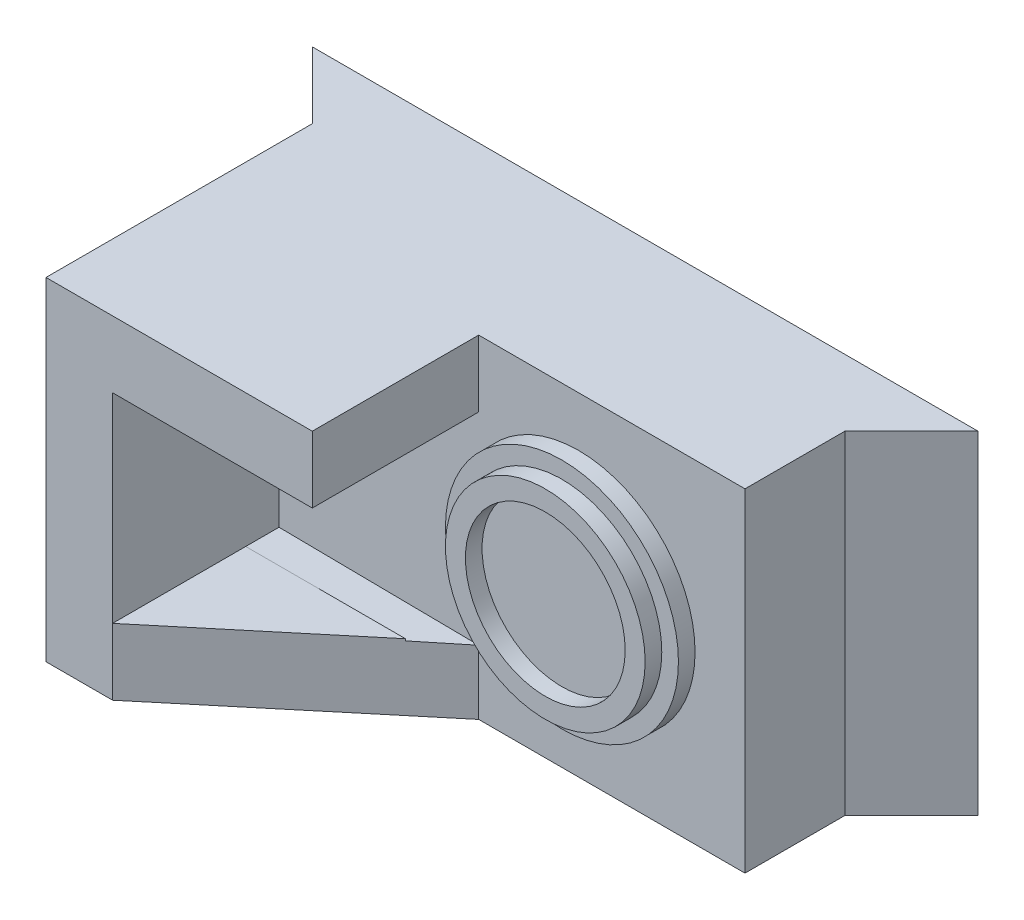
ISO-10303-21;
HEADER;
FILE_DESCRIPTION(('STEP AP214'),'2;1');
FILE_NAME('part.step','',(''),(''),'','','');
FILE_SCHEMA(('AUTOMOTIVE_DESIGN { 1 0 10303 214 1 1 1 1 }'));
ENDSEC;
DATA;
#1=APPLICATION_CONTEXT('core data for automotive mechanical design processes');
#2=APPLICATION_PROTOCOL_DEFINITION('international standard','automotive_design',2000,#1);
#3=PRODUCT_CONTEXT('',#1,'mechanical');
#4=PRODUCT('Part','Part','',(#3));
#5=PRODUCT_RELATED_PRODUCT_CATEGORY('part','',(#4));
#6=PRODUCT_DEFINITION_FORMATION('','',#4);
#7=PRODUCT_DEFINITION_CONTEXT('part definition',#1,'design');
#8=PRODUCT_DEFINITION('design','',#6,#7);
#9=PRODUCT_DEFINITION_SHAPE('','',#8);
#10=(LENGTH_UNIT() NAMED_UNIT(*) SI_UNIT(.MILLI.,.METRE.));
#11=(NAMED_UNIT(*) PLANE_ANGLE_UNIT() SI_UNIT($,.RADIAN.));
#12=(NAMED_UNIT(*) SI_UNIT($,.STERADIAN.) SOLID_ANGLE_UNIT());
#13=UNCERTAINTY_MEASURE_WITH_UNIT(LENGTH_MEASURE(1.E-05),#10,'distance_accuracy_value','');
#14=(GEOMETRIC_REPRESENTATION_CONTEXT(3) GLOBAL_UNCERTAINTY_ASSIGNED_CONTEXT((#13)) GLOBAL_UNIT_ASSIGNED_CONTEXT((#10,
#11,#12)) REPRESENTATION_CONTEXT('',''));
#15=CARTESIAN_POINT('',(0.,0.,0.));
#16=DIRECTION('',(0.,0.,1.));
#17=DIRECTION('',(1.,0.,0.));
#18=AXIS2_PLACEMENT_3D('',#15,#16,#17);
#19=CARTESIAN_POINT('',(34.8916408668731,-6.11455108359133,27.5));
#20=DIRECTION('',(0.,0.,1.));
#21=DIRECTION('',(1.,0.,0.));
#22=AXIS2_PLACEMENT_3D('',#19,#20,#21);
#23=CYLINDRICAL_SURFACE('',#22,17.5);
#24=CARTESIAN_POINT('',(34.8916408668731,-6.11455108359133,25.));
#25=DIRECTION('',(0.,0.,1.));
#26=DIRECTION('',(1.,0.,0.));
#27=AXIS2_PLACEMENT_3D('',#24,#25,#26);
#28=CIRCLE('',#27,17.5);
#29=CARTESIAN_POINT('',(52.3916408668731,-6.11455108359133,25.));
#30=VERTEX_POINT('',#29);
#31=EDGE_CURVE('E264',#30,#30,#28,.T.);
#32=ORIENTED_EDGE('',*,*,#31,.T.);
#33=EDGE_LOOP('',(#32));
#34=FACE_BOUND('',#33,.T.);
#35=CARTESIAN_POINT('',(34.8916408668731,-6.11455108359133,27.5));
#36=DIRECTION('',(0.,0.,1.));
#37=DIRECTION('',(1.,0.,0.));
#38=AXIS2_PLACEMENT_3D('',#35,#36,#37);
#39=CIRCLE('',#38,17.5);
#40=CARTESIAN_POINT('',(52.3916408668731,-6.11455108359133,27.5));
#41=VERTEX_POINT('',#40);
#42=EDGE_CURVE('E279',#41,#41,#39,.T.);
#43=ORIENTED_EDGE('',*,*,#42,.F.);
#44=EDGE_LOOP('',(#43));
#45=FACE_BOUND('',#44,.T.);
#46=ADVANCED_FACE('F45',(#34,#45),#23,.T.);
#47=CARTESIAN_POINT('',(59.8916408668731,18.8854489164087,10.));
#48=DIRECTION('',(-1.,0.,0.));
#49=DIRECTION('',(0.,0.,1.));
#50=AXIS2_PLACEMENT_3D('',#47,#48,#49);
#51=PLANE('',#50);
#52=DIRECTION('',(0.,1.,0.));
#53=VECTOR('',#52,1.);
#54=CARTESIAN_POINT('',(59.8916408668731,0.,25.));
#55=LINE('',#54,#53);
#56=CARTESIAN_POINT('',(59.8916408668731,-31.1145510835913,25.));
#57=VERTEX_POINT('',#56);
#58=CARTESIAN_POINT('',(59.8916408668731,18.8854489164087,25.));
#59=VERTEX_POINT('',#58);
#60=EDGE_CURVE('E256',#57,#59,#55,.T.);
#61=ORIENTED_EDGE('',*,*,#60,.F.);
#62=DIRECTION('',(0.,0.,-1.));
#63=VECTOR('',#62,1.);
#64=CARTESIAN_POINT('',(59.8916408668731,-31.1145510835913,10.));
#65=LINE('',#64,#63);
#66=CARTESIAN_POINT('',(59.8916408668731,-31.1145510835913,10.));
#67=VERTEX_POINT('',#66);
#68=EDGE_CURVE('E202',#57,#67,#65,.T.);
#69=ORIENTED_EDGE('',*,*,#68,.T.);
#70=DIRECTION('',(0.,-1.,0.));
#71=VECTOR('',#70,1.);
#72=CARTESIAN_POINT('',(59.8916408668731,18.8854489164087,10.));
#73=LINE('',#72,#71);
#74=CARTESIAN_POINT('',(59.8916408668731,18.8854489164087,10.));
#75=VERTEX_POINT('',#74);
#76=EDGE_CURVE('E192',#75,#67,#73,.T.);
#77=ORIENTED_EDGE('',*,*,#76,.F.);
#78=DIRECTION('',(0.,0.,-1.));
#79=VECTOR('',#78,1.);
#80=CARTESIAN_POINT('',(59.8916408668731,18.8854489164087,10.));
#81=LINE('',#80,#79);
#82=EDGE_CURVE('E211',#59,#75,#81,.T.);
#83=ORIENTED_EDGE('',*,*,#82,.F.);
#84=EDGE_LOOP('',(#61,#69,#77,#83));
#85=FACE_BOUND('',#84,.T.);
#86=ADVANCED_FACE('F321',(#85),#51,.F.);
#87=CARTESIAN_POINT('',(19.8916408668731,-31.1145510835913,30.));
#88=DIRECTION('',(-1.,0.,0.));
#89=DIRECTION('',(0.,0.,1.));
#90=AXIS2_PLACEMENT_3D('',#87,#88,#89);
#91=PLANE('',#90);
#92=DIRECTION('',(0.,-1.,0.));
#93=VECTOR('',#92,1.);
#94=CARTESIAN_POINT('',(19.8916408668731,-31.1145510835913,50.));
#95=LINE('',#94,#93);
#96=CARTESIAN_POINT('',(19.8916408668731,18.8854489164087,50.));
#97=VERTEX_POINT('',#96);
#98=CARTESIAN_POINT('',(19.8916408668731,8.88544891640867,50.));
#99=VERTEX_POINT('',#98);
#100=EDGE_CURVE('E185',#97,#99,#95,.T.);
#101=ORIENTED_EDGE('',*,*,#100,.T.);
#102=DIRECTION('',(0.,0.,1.));
#103=VECTOR('',#102,1.);
#104=CARTESIAN_POINT('',(19.8916408668731,8.88544891640867,30.));
#105=LINE('',#104,#103);
#106=CARTESIAN_POINT('',(19.8916408668731,8.88544891640867,25.));
#107=VERTEX_POINT('',#106);
#108=EDGE_CURVE('E186',#107,#99,#105,.T.);
#109=ORIENTED_EDGE('',*,*,#108,.F.);
#110=DIRECTION('',(0.,-1.,0.));
#111=VECTOR('',#110,1.);
#112=CARTESIAN_POINT('',(19.8916408668731,0.,25.));
#113=LINE('',#112,#111);
#114=CARTESIAN_POINT('',(19.8916408668731,18.8854489164087,25.));
#115=VERTEX_POINT('',#114);
#116=EDGE_CURVE('E176',#115,#107,#113,.T.);
#117=ORIENTED_EDGE('',*,*,#116,.F.);
#118=DIRECTION('',(0.,0.,1.));
#119=VECTOR('',#118,1.);
#120=CARTESIAN_POINT('',(19.8916408668731,18.8854489164087,30.));
#121=LINE('',#120,#119);
#122=EDGE_CURVE('E190',#115,#97,#121,.T.);
#123=ORIENTED_EDGE('',*,*,#122,.T.);
#124=EDGE_LOOP('',(#101,#109,#117,#123));
#125=FACE_BOUND('',#124,.T.);
#126=ADVANCED_FACE('F248',(#125),#91,.F.);
#127=CARTESIAN_POINT('',(-30.1083591331269,-31.1145510835913,50.));
#128=DIRECTION('',(0.,1.,0.));
#129=DIRECTION('',(0.,0.,1.));
#130=AXIS2_PLACEMENT_3D('',#127,#128,#129);
#131=PLANE('',#130);
#132=DIRECTION('',(1.,0.,0.));
#133=VECTOR('',#132,1.);
#134=CARTESIAN_POINT('',(0.,-31.1145510835913,25.));
#135=LINE('',#134,#133);
#136=CARTESIAN_POINT('',(19.8916408668731,-31.1145510835913,25.));
#137=VERTEX_POINT('',#136);
#138=EDGE_CURVE('E257',#137,#57,#135,.T.);
#139=ORIENTED_EDGE('',*,*,#138,.F.);
#140=DIRECTION('',(0.768221279597376,0.,-0.64018439966448));
#141=VECTOR('',#140,1.);
#142=CARTESIAN_POINT('',(-10.1083591331269,-31.1145510835913,50.));
#143=LINE('',#142,#141);
#144=CARTESIAN_POINT('',(-10.1083591331269,-31.1145510835913,50.));
#145=VERTEX_POINT('',#144);
#146=EDGE_CURVE('E150',#145,#137,#143,.T.);
#147=ORIENTED_EDGE('',*,*,#146,.F.);
#148=DIRECTION('',(1.,0.,0.));
#149=VECTOR('',#148,1.);
#150=CARTESIAN_POINT('',(-30.1083591331269,-31.1145510835913,50.));
#151=LINE('',#150,#149);
#152=CARTESIAN_POINT('',(-20.1083591331269,-31.1145510835913,50.));
#153=VERTEX_POINT('',#152);
#154=EDGE_CURVE('E161',#153,#145,#151,.T.);
#155=ORIENTED_EDGE('',*,*,#154,.F.);
#156=DIRECTION('',(0.,0.,1.));
#157=VECTOR('',#156,1.);
#158=CARTESIAN_POINT('',(-20.1083591331269,-31.1145510835913,10.));
#159=LINE('',#158,#157);
#160=CARTESIAN_POINT('',(-20.1083591331269,-31.1145510835913,10.));
#161=VERTEX_POINT('',#160);
#162=EDGE_CURVE('E195',#161,#153,#159,.T.);
#163=ORIENTED_EDGE('',*,*,#162,.F.);
#164=DIRECTION('',(0.707106781186547,0.,0.707106781186548));
#165=VECTOR('',#164,1.);
#166=CARTESIAN_POINT('',(-30.1083591331269,-31.1145510835913,0.));
#167=LINE('',#166,#165);
#168=CARTESIAN_POINT('',(-30.1083591331269,-31.1145510835913,0.));
#169=VERTEX_POINT('',#168);
#170=EDGE_CURVE('E199',#169,#161,#167,.T.);
#171=ORIENTED_EDGE('',*,*,#170,.F.);
#172=DIRECTION('',(1.,0.,0.));
#173=VECTOR('',#172,1.);
#174=CARTESIAN_POINT('',(-30.1083591331269,-31.1145510835913,0.));
#175=LINE('',#174,#173);
#176=CARTESIAN_POINT('',(69.8916408668731,-31.1145510835913,0.));
#177=VERTEX_POINT('',#176);
#178=EDGE_CURVE('E220',#169,#177,#175,.T.);
#179=ORIENTED_EDGE('',*,*,#178,.T.);
#180=DIRECTION('',(0.707106781186547,0.,-0.707106781186548));
#181=VECTOR('',#180,1.);
#182=CARTESIAN_POINT('',(69.8916408668731,-31.1145510835913,0.));
#183=LINE('',#182,#181);
#184=EDGE_CURVE('E68',#67,#177,#183,.T.);
#185=ORIENTED_EDGE('',*,*,#184,.F.);
#186=ORIENTED_EDGE('',*,*,#68,.F.);
#187=EDGE_LOOP('',(#139,#147,#155,#163,#171,#179,#185,#186));
#188=FACE_BOUND('',#187,.T.);
#189=ADVANCED_FACE('F47',(#188),#131,.F.);
#190=CARTESIAN_POINT('',(-30.1083591331269,18.8854489164087,50.));
#191=DIRECTION('',(0.,-1.,0.));
#192=DIRECTION('',(1.,0.,0.));
#193=AXIS2_PLACEMENT_3D('',#190,#191,#192);
#194=PLANE('',#193);
#195=ORIENTED_EDGE('',*,*,#122,.F.);
#196=DIRECTION('',(-1.,0.,0.));
#197=VECTOR('',#196,1.);
#198=CARTESIAN_POINT('',(0.,18.8854489164087,25.));
#199=LINE('',#198,#197);
#200=EDGE_CURVE('E180',#59,#115,#199,.T.);
#201=ORIENTED_EDGE('',*,*,#200,.F.);
#202=ORIENTED_EDGE('',*,*,#82,.T.);
#203=DIRECTION('',(0.707106781186547,0.,-0.707106781186548));
#204=VECTOR('',#203,1.);
#205=CARTESIAN_POINT('',(69.8916408668731,18.8854489164087,0.));
#206=LINE('',#205,#204);
#207=CARTESIAN_POINT('',(69.8916408668731,18.8854489164087,0.));
#208=VERTEX_POINT('',#207);
#209=EDGE_CURVE('E209',#75,#208,#206,.T.);
#210=ORIENTED_EDGE('',*,*,#209,.T.);
#211=DIRECTION('',(-1.,0.,0.));
#212=VECTOR('',#211,1.);
#213=CARTESIAN_POINT('',(-30.1083591331269,18.8854489164087,0.));
#214=LINE('',#213,#212);
#215=CARTESIAN_POINT('',(-30.1083591331269,18.8854489164087,0.));
#216=VERTEX_POINT('',#215);
#217=EDGE_CURVE('E217',#208,#216,#214,.T.);
#218=ORIENTED_EDGE('',*,*,#217,.T.);
#219=DIRECTION('',(0.707106781186547,0.,0.707106781186548));
#220=VECTOR('',#219,1.);
#221=CARTESIAN_POINT('',(-30.1083591331269,18.8854489164087,0.));
#222=LINE('',#221,#220);
#223=CARTESIAN_POINT('',(-20.1083591331269,18.8854489164087,10.));
#224=VERTEX_POINT('',#223);
#225=EDGE_CURVE('E60',#216,#224,#222,.T.);
#226=ORIENTED_EDGE('',*,*,#225,.T.);
#227=DIRECTION('',(0.,0.,1.));
#228=VECTOR('',#227,1.);
#229=CARTESIAN_POINT('',(-20.1083591331269,18.8854489164087,10.));
#230=LINE('',#229,#228);
#231=CARTESIAN_POINT('',(-20.1083591331269,18.8854489164087,50.));
#232=VERTEX_POINT('',#231);
#233=EDGE_CURVE('E194',#224,#232,#230,.T.);
#234=ORIENTED_EDGE('',*,*,#233,.T.);
#235=DIRECTION('',(-1.,0.,0.));
#236=VECTOR('',#235,1.);
#237=CARTESIAN_POINT('',(-30.1083591331269,18.8854489164087,50.));
#238=LINE('',#237,#236);
#239=EDGE_CURVE('E53',#97,#232,#238,.T.);
#240=ORIENTED_EDGE('',*,*,#239,.F.);
#241=EDGE_LOOP('',(#195,#201,#202,#210,#218,#226,#234,#240));
#242=FACE_BOUND('',#241,.T.);
#243=ADVANCED_FACE('F226',(#242),#194,.F.);
#244=CARTESIAN_POINT('',(0.,0.,50.));
#245=DIRECTION('',(0.,0.,1.));
#246=DIRECTION('',(1.,0.,0.));
#247=AXIS2_PLACEMENT_3D('',#244,#245,#246);
#248=PLANE('',#247);
#249=DIRECTION('',(0.,-1.,0.));
#250=VECTOR('',#249,1.);
#251=CARTESIAN_POINT('',(-10.1083591331269,-21.1145510835913,50.));
#252=LINE('',#251,#250);
#253=CARTESIAN_POINT('',(-10.1083591331269,-21.1145510835913,50.));
#254=VERTEX_POINT('',#253);
#255=EDGE_CURVE('E143',#254,#145,#252,.T.);
#256=ORIENTED_EDGE('',*,*,#255,.F.);
#257=DIRECTION('',(0.,-1.,0.));
#258=VECTOR('',#257,1.);
#259=CARTESIAN_POINT('',(-10.1083591331269,8.88544891640867,50.));
#260=LINE('',#259,#258);
#261=CARTESIAN_POINT('',(-10.1083591331269,8.88544891640867,50.));
#262=VERTEX_POINT('',#261);
#263=EDGE_CURVE('E158',#262,#254,#260,.T.);
#264=ORIENTED_EDGE('',*,*,#263,.F.);
#265=DIRECTION('',(-1.,0.,0.));
#266=VECTOR('',#265,1.);
#267=CARTESIAN_POINT('',(-10.1083591331269,8.88544891640867,50.));
#268=LINE('',#267,#266);
#269=EDGE_CURVE('E170',#99,#262,#268,.T.);
#270=ORIENTED_EDGE('',*,*,#269,.F.);
#271=ORIENTED_EDGE('',*,*,#100,.F.);
#272=ORIENTED_EDGE('',*,*,#239,.T.);
#273=DIRECTION('',(0.,-1.,0.));
#274=VECTOR('',#273,1.);
#275=CARTESIAN_POINT('',(-20.1083591331269,18.8854489164087,50.));
#276=LINE('',#275,#274);
#277=EDGE_CURVE('E204',#232,#153,#276,.T.);
#278=ORIENTED_EDGE('',*,*,#277,.T.);
#279=ORIENTED_EDGE('',*,*,#154,.T.);
#280=EDGE_LOOP('',(#256,#264,#270,#271,#272,#278,#279));
#281=FACE_BOUND('',#280,.T.);
#282=ADVANCED_FACE('F155',(#281),#248,.T.);
#283=CARTESIAN_POINT('',(0.,0.,0.));
#284=DIRECTION('',(0.,0.,1.));
#285=DIRECTION('',(1.,0.,0.));
#286=AXIS2_PLACEMENT_3D('',#283,#284,#285);
#287=PLANE('',#286);
#288=DIRECTION('',(0.,-1.,0.));
#289=VECTOR('',#288,1.);
#290=CARTESIAN_POINT('',(-30.1083591331269,18.8854489164087,0.));
#291=LINE('',#290,#289);
#292=EDGE_CURVE('E206',#216,#169,#291,.T.);
#293=ORIENTED_EDGE('',*,*,#292,.F.);
#294=ORIENTED_EDGE('',*,*,#217,.F.);
#295=DIRECTION('',(0.,1.,0.));
#296=VECTOR('',#295,1.);
#297=CARTESIAN_POINT('',(69.8916408668731,18.8854489164087,0.));
#298=LINE('',#297,#296);
#299=EDGE_CURVE('E222',#177,#208,#298,.T.);
#300=ORIENTED_EDGE('',*,*,#299,.F.);
#301=ORIENTED_EDGE('',*,*,#178,.F.);
#302=EDGE_LOOP('',(#293,#294,#300,#301));
#303=FACE_BOUND('',#302,.T.);
#304=ADVANCED_FACE('F231',(#303),#287,.F.);
#305=CARTESIAN_POINT('',(69.8916408668731,18.8854489164087,0.));
#306=DIRECTION('',(-0.707106781186548,0.,-0.707106781186547));
#307=DIRECTION('',(-0.707106781186547,0.,0.707106781186548));
#308=AXIS2_PLACEMENT_3D('',#305,#306,#307);
#309=PLANE('',#308);
#310=ORIENTED_EDGE('',*,*,#184,.T.);
#311=ORIENTED_EDGE('',*,*,#299,.T.);
#312=ORIENTED_EDGE('',*,*,#209,.F.);
#313=ORIENTED_EDGE('',*,*,#76,.T.);
#314=EDGE_LOOP('',(#310,#311,#312,#313));
#315=FACE_BOUND('',#314,.T.);
#316=ADVANCED_FACE('F345',(#315),#309,.F.);
#317=CARTESIAN_POINT('',(-20.1083591331269,18.8854489164087,10.));
#318=DIRECTION('',(1.,0.,0.));
#319=DIRECTION('',(0.,0.,-1.));
#320=AXIS2_PLACEMENT_3D('',#317,#318,#319);
#321=PLANE('',#320);
#322=ORIENTED_EDGE('',*,*,#162,.T.);
#323=ORIENTED_EDGE('',*,*,#277,.F.);
#324=ORIENTED_EDGE('',*,*,#233,.F.);
#325=DIRECTION('',(0.,-1.,0.));
#326=VECTOR('',#325,1.);
#327=CARTESIAN_POINT('',(-20.1083591331269,18.8854489164087,10.));
#328=LINE('',#327,#326);
#329=EDGE_CURVE('E198',#224,#161,#328,.T.);
#330=ORIENTED_EDGE('',*,*,#329,.T.);
#331=EDGE_LOOP('',(#322,#323,#324,#330));
#332=FACE_BOUND('',#331,.T.);
#333=ADVANCED_FACE('F239',(#332),#321,.F.);
#334=CARTESIAN_POINT('',(-30.1083591331269,18.8854489164087,0.));
#335=DIRECTION('',(0.707106781186548,0.,-0.707106781186547));
#336=DIRECTION('',(-0.707106781186547,0.,-0.707106781186548));
#337=AXIS2_PLACEMENT_3D('',#334,#335,#336);
#338=PLANE('',#337);
#339=ORIENTED_EDGE('',*,*,#170,.T.);
#340=ORIENTED_EDGE('',*,*,#329,.F.);
#341=ORIENTED_EDGE('',*,*,#225,.F.);
#342=ORIENTED_EDGE('',*,*,#292,.T.);
#343=EDGE_LOOP('',(#339,#340,#341,#342));
#344=FACE_BOUND('',#343,.T.);
#345=ADVANCED_FACE('F233',(#344),#338,.F.);
#346=CARTESIAN_POINT('',(-10.1083591331269,8.88544891640867,30.));
#347=DIRECTION('',(-1.,0.,0.));
#348=DIRECTION('',(0.,0.,1.));
#349=AXIS2_PLACEMENT_3D('',#346,#347,#348);
#350=PLANE('',#349);
#351=DIRECTION('',(0.,0.,1.));
#352=VECTOR('',#351,1.);
#353=CARTESIAN_POINT('',(-10.1083591331269,-21.1145510835913,30.));
#354=LINE('',#353,#352);
#355=CARTESIAN_POINT('',(-10.1083591331269,-21.1145510835913,30.));
#356=VERTEX_POINT('',#355);
#357=EDGE_CURVE('E164',#356,#254,#354,.T.);
#358=ORIENTED_EDGE('',*,*,#357,.F.);
#359=CARTESIAN_POINT('',(-10.1083591331269,-21.1145510835913,25.));
#360=VERTEX_POINT('',#359);
#361=EDGE_CURVE('E169',#360,#356,#354,.T.);
#362=ORIENTED_EDGE('',*,*,#361,.F.);
#363=DIRECTION('',(0.,-1.,0.));
#364=VECTOR('',#363,1.);
#365=CARTESIAN_POINT('',(-10.1083591331269,0.,25.));
#366=LINE('',#365,#364);
#367=CARTESIAN_POINT('',(-10.1083591331269,8.88544891640867,25.));
#368=VERTEX_POINT('',#367);
#369=EDGE_CURVE('E272',#368,#360,#366,.T.);
#370=ORIENTED_EDGE('',*,*,#369,.F.);
#371=DIRECTION('',(0.,0.,1.));
#372=VECTOR('',#371,1.);
#373=CARTESIAN_POINT('',(-10.1083591331269,8.88544891640867,30.));
#374=LINE('',#373,#372);
#375=EDGE_CURVE('E174',#368,#262,#374,.T.);
#376=ORIENTED_EDGE('',*,*,#375,.T.);
#377=ORIENTED_EDGE('',*,*,#263,.T.);
#378=EDGE_LOOP('',(#358,#362,#370,#376,#377));
#379=FACE_BOUND('',#378,.T.);
#380=ADVANCED_FACE('F172',(#379),#350,.F.);
#381=CARTESIAN_POINT('',(-10.1083591331269,8.88544891640867,30.));
#382=DIRECTION('',(0.,1.,0.));
#383=DIRECTION('',(0.,0.,1.));
#384=AXIS2_PLACEMENT_3D('',#381,#382,#383);
#385=PLANE('',#384);
#386=ORIENTED_EDGE('',*,*,#269,.T.);
#387=ORIENTED_EDGE('',*,*,#375,.F.);
#388=DIRECTION('',(-1.,0.,0.));
#389=VECTOR('',#388,1.);
#390=CARTESIAN_POINT('',(0.,8.88544891640867,25.));
#391=LINE('',#390,#389);
#392=EDGE_CURVE('E268',#107,#368,#391,.T.);
#393=ORIENTED_EDGE('',*,*,#392,.F.);
#394=ORIENTED_EDGE('',*,*,#108,.T.);
#395=EDGE_LOOP('',(#386,#387,#393,#394));
#396=FACE_BOUND('',#395,.T.);
#397=ADVANCED_FACE('F333',(#396),#385,.F.);
#398=CARTESIAN_POINT('',(-10.1083591331269,-21.1145510835913,30.));
#399=DIRECTION('',(0.,-1.,0.));
#400=DIRECTION('',(0.,0.,-1.));
#401=AXIS2_PLACEMENT_3D('',#398,#399,#400);
#402=PLANE('',#401);
#403=ORIENTED_EDGE('',*,*,#357,.T.);
#404=DIRECTION('',(0.768221279597376,0.,-0.64018439966448));
#405=VECTOR('',#404,1.);
#406=CARTESIAN_POINT('',(-10.1083591331269,-21.1145510835913,50.));
#407=LINE('',#406,#405);
#408=CARTESIAN_POINT('',(13.8916408668731,-21.1145510835913,30.));
#409=VERTEX_POINT('',#408);
#410=EDGE_CURVE('E140',#254,#409,#407,.T.);
#411=ORIENTED_EDGE('',*,*,#410,.T.);
#412=DIRECTION('',(-1.,0.,0.));
#413=VECTOR('',#412,1.);
#414=CARTESIAN_POINT('',(-10.1083591331269,-21.1145510835913,30.));
#415=LINE('',#414,#413);
#416=EDGE_CURVE('E166',#409,#356,#415,.T.);
#417=ORIENTED_EDGE('',*,*,#416,.T.);
#418=EDGE_LOOP('',(#403,#411,#417));
#419=FACE_BOUND('',#418,.T.);
#420=ADVANCED_FACE('F165',(#419),#402,.F.);
#421=CARTESIAN_POINT('',(0.,0.,25.));
#422=DIRECTION('',(0.,0.,1.));
#423=DIRECTION('',(1.,0.,0.));
#424=AXIS2_PLACEMENT_3D('',#421,#422,#423);
#425=PLANE('',#424);
#426=DIRECTION('',(0.999932698501029,-0.0116016580043561,0.));
#427=VECTOR('',#426,1.);
#428=CARTESIAN_POINT('',(-0.246307883814223,-21.2289749303037,25.));
#429=LINE('',#428,#427);
#430=CARTESIAN_POINT('',(19.8916408668731,-21.4626242495678,25.));
#431=VERTEX_POINT('',#430);
#432=EDGE_CURVE('E274',#360,#431,#429,.T.);
#433=ORIENTED_EDGE('',*,*,#432,.T.);
#434=DIRECTION('',(0.,-1.,0.));
#435=VECTOR('',#434,1.);
#436=CARTESIAN_POINT('',(19.8916408668731,0.,25.));
#437=LINE('',#436,#435);
#438=EDGE_CURVE('E261',#431,#137,#437,.T.);
#439=ORIENTED_EDGE('',*,*,#438,.T.);
#440=ORIENTED_EDGE('',*,*,#138,.T.);
#441=ORIENTED_EDGE('',*,*,#60,.T.);
#442=ORIENTED_EDGE('',*,*,#200,.T.);
#443=ORIENTED_EDGE('',*,*,#116,.T.);
#444=ORIENTED_EDGE('',*,*,#392,.T.);
#445=ORIENTED_EDGE('',*,*,#369,.T.);
#446=EDGE_LOOP('',(#433,#439,#440,#441,#442,#443,#444,#445));
#447=FACE_BOUND('',#446,.T.);
#448=ORIENTED_EDGE('',*,*,#31,.F.);
#449=EDGE_LOOP('',(#448));
#450=FACE_BOUND('',#449,.T.);
#451=ADVANCED_FACE('F253',(#447,#450),#425,.T.);
#452=CARTESIAN_POINT('',(0.,0.,30.));
#453=DIRECTION('',(0.,0.,1.));
#454=DIRECTION('',(1.,0.,0.));
#455=AXIS2_PLACEMENT_3D('',#452,#453,#454);
#456=PLANE('',#455);
#457=ORIENTED_EDGE('',*,*,#416,.F.);
#458=DIRECTION('',(0.,-1.,0.));
#459=VECTOR('',#458,1.);
#460=CARTESIAN_POINT('',(13.8916408668731,0.,30.));
#461=LINE('',#460,#459);
#462=CARTESIAN_POINT('',(13.8916408668731,-21.3930096163725,30.));
#463=VERTEX_POINT('',#462);
#464=EDGE_CURVE('E146',#409,#463,#461,.T.);
#465=ORIENTED_EDGE('',*,*,#464,.T.);
#466=DIRECTION('',(0.999932698501029,-0.0116016580043561,0.));
#467=VECTOR('',#466,1.);
#468=CARTESIAN_POINT('',(-0.246307883814223,-21.2289749303037,30.));
#469=LINE('',#468,#467);
#470=EDGE_CURVE('E269',#356,#463,#469,.T.);
#471=ORIENTED_EDGE('',*,*,#470,.F.);
#472=EDGE_LOOP('',(#457,#465,#471));
#473=FACE_BOUND('',#472,.T.);
#474=ADVANCED_FACE('F420',(#473),#456,.F.);
#475=CARTESIAN_POINT('',(-0.246307883814223,-21.2289749303037,25.));
#476=DIRECTION('',(-0.0116016580043561,-0.999932698501029,0.));
#477=DIRECTION('',(0.999932698501029,-0.0116016580043561,0.));
#478=AXIS2_PLACEMENT_3D('',#475,#476,#477);
#479=PLANE('',#478);
#480=ORIENTED_EDGE('',*,*,#470,.T.);
#481=DIRECTION('',(0.76819076541734,-0.00891288639309096,-0.640158971181116));
#482=VECTOR('',#481,1.);
#483=CARTESIAN_POINT('',(8.00629416586788,-21.3247252410696,34.904455584171));
#484=LINE('',#483,#482);
#485=EDGE_CURVE('E11',#463,#431,#484,.T.);
#486=ORIENTED_EDGE('',*,*,#485,.T.);
#487=ORIENTED_EDGE('',*,*,#432,.F.);
#488=ORIENTED_EDGE('',*,*,#361,.T.);
#489=EDGE_LOOP('',(#480,#486,#487,#488));
#490=FACE_BOUND('',#489,.T.);
#491=ADVANCED_FACE('F408',(#490),#479,.F.);
#492=CARTESIAN_POINT('',(-10.1083591331269,-21.1145510835913,50.));
#493=DIRECTION('',(-0.64018439966448,0.,-0.768221279597376));
#494=DIRECTION('',(-0.768221279597376,0.,0.64018439966448));
#495=AXIS2_PLACEMENT_3D('',#492,#493,#494);
#496=PLANE('',#495);
#497=ORIENTED_EDGE('',*,*,#410,.F.);
#498=ORIENTED_EDGE('',*,*,#255,.T.);
#499=ORIENTED_EDGE('',*,*,#146,.T.);
#500=ORIENTED_EDGE('',*,*,#438,.F.);
#501=ORIENTED_EDGE('',*,*,#485,.F.);
#502=ORIENTED_EDGE('',*,*,#464,.F.);
#503=EDGE_LOOP('',(#497,#498,#499,#500,#501,#502));
#504=FACE_BOUND('',#503,.T.);
#505=ADVANCED_FACE('F142',(#504),#496,.F.);
#506=CARTESIAN_POINT('',(34.8916408668731,-6.11455108359133,27.5));
#507=DIRECTION('',(0.,0.,1.));
#508=DIRECTION('',(1.,0.,0.));
#509=AXIS2_PLACEMENT_3D('',#506,#507,#508);
#510=PLANE('',#509);
#511=CARTESIAN_POINT('',(34.8916408668731,-6.11455108359133,27.5));
#512=DIRECTION('',(0.,0.,1.));
#513=DIRECTION('',(1.,0.,0.));
#514=AXIS2_PLACEMENT_3D('',#511,#512,#513);
#515=CIRCLE('',#514,15.);
#516=CARTESIAN_POINT('',(49.8916408668731,-6.11455108359133,27.5));
#517=VERTEX_POINT('',#516);
#518=EDGE_CURVE('E283',#517,#517,#515,.T.);
#519=ORIENTED_EDGE('',*,*,#518,.F.);
#520=EDGE_LOOP('',(#519));
#521=FACE_BOUND('',#520,.T.);
#522=ORIENTED_EDGE('',*,*,#42,.T.);
#523=EDGE_LOOP('',(#522));
#524=FACE_BOUND('',#523,.T.);
#525=ADVANCED_FACE('F312',(#521,#524),#510,.T.);
#526=CARTESIAN_POINT('',(34.8916408668731,-6.11455108359133,27.5));
#527=DIRECTION('',(0.,0.,1.));
#528=DIRECTION('',(1.,0.,0.));
#529=AXIS2_PLACEMENT_3D('',#526,#527,#528);
#530=CYLINDRICAL_SURFACE('',#529,15.);
#531=ORIENTED_EDGE('',*,*,#518,.T.);
#532=EDGE_LOOP('',(#531));
#533=FACE_BOUND('',#532,.T.);
#534=CARTESIAN_POINT('',(34.8916408668731,-6.11455108359133,30.));
#535=DIRECTION('',(0.,0.,1.));
#536=DIRECTION('',(1.,0.,0.));
#537=AXIS2_PLACEMENT_3D('',#534,#535,#536);
#538=CIRCLE('',#537,15.);
#539=CARTESIAN_POINT('',(49.8916408668731,-6.11455108359133,30.));
#540=VERTEX_POINT('',#539);
#541=EDGE_CURVE('E284',#540,#540,#538,.T.);
#542=ORIENTED_EDGE('',*,*,#541,.F.);
#543=EDGE_LOOP('',(#542));
#544=FACE_BOUND('',#543,.T.);
#545=ADVANCED_FACE('F307',(#533,#544),#530,.T.);
#546=CARTESIAN_POINT('',(0.,0.,30.));
#547=DIRECTION('',(0.,0.,-1.));
#548=DIRECTION('',(-1.,0.,0.));
#549=AXIS2_PLACEMENT_3D('',#546,#547,#548);
#550=PLANE('',#549);
#551=CARTESIAN_POINT('',(34.8916408668731,-6.11455108359133,30.));
#552=DIRECTION('',(0.,0.,1.));
#553=DIRECTION('',(1.,0.,0.));
#554=AXIS2_PLACEMENT_3D('',#551,#552,#553);
#555=CIRCLE('',#554,12.);
#556=CARTESIAN_POINT('',(46.8916408668731,-6.11455108359133,30.));
#557=VERTEX_POINT('',#556);
#558=EDGE_CURVE('E290',#557,#557,#555,.T.);
#559=ORIENTED_EDGE('',*,*,#558,.F.);
#560=EDGE_LOOP('',(#559));
#561=FACE_BOUND('',#560,.T.);
#562=ORIENTED_EDGE('',*,*,#541,.T.);
#563=EDGE_LOOP('',(#562));
#564=FACE_BOUND('',#563,.T.);
#565=ADVANCED_FACE('F301',(#561,#564),#550,.F.);
#566=CARTESIAN_POINT('',(34.8916408668731,-6.11455108359133,27.5));
#567=DIRECTION('',(0.,0.,1.));
#568=DIRECTION('',(1.,0.,0.));
#569=AXIS2_PLACEMENT_3D('',#566,#567,#568);
#570=CYLINDRICAL_SURFACE('',#569,12.);
#571=CARTESIAN_POINT('',(34.8916408668731,-6.11455108359133,27.5));
#572=DIRECTION('',(0.,0.,1.));
#573=DIRECTION('',(1.,0.,0.));
#574=AXIS2_PLACEMENT_3D('',#571,#572,#573);
#575=CIRCLE('',#574,12.);
#576=CARTESIAN_POINT('',(46.8916408668731,-6.11455108359133,27.5));
#577=VERTEX_POINT('',#576);
#578=EDGE_CURVE('E287',#577,#577,#575,.T.);
#579=ORIENTED_EDGE('',*,*,#578,.F.);
#580=EDGE_LOOP('',(#579));
#581=FACE_BOUND('',#580,.T.);
#582=ORIENTED_EDGE('',*,*,#558,.T.);
#583=EDGE_LOOP('',(#582));
#584=FACE_BOUND('',#583,.T.);
#585=ADVANCED_FACE('F298',(#581,#584),#570,.F.);
#586=CARTESIAN_POINT('',(34.8916408668731,-6.11455108359133,27.5));
#587=DIRECTION('',(0.,0.,1.));
#588=DIRECTION('',(1.,0.,0.));
#589=AXIS2_PLACEMENT_3D('',#586,#587,#588);
#590=PLANE('',#589);
#591=ORIENTED_EDGE('',*,*,#578,.T.);
#592=EDGE_LOOP('',(#591));
#593=FACE_BOUND('',#592,.T.);
#594=ADVANCED_FACE('F296',(#593),#590,.T.);
#595=CLOSED_SHELL('',(#46,#86,#126,#189,#243,#282,#304,#316,#333,#345,#380,#397,#420,#451,#474,
#491,#505,#525,#545,#565,#585,#594));
#596=MANIFOLD_SOLID_BREP('B2',#595);
#597=ADVANCED_BREP_SHAPE_REPRESENTATION('',(#18,#596),#14);
#598=SHAPE_DEFINITION_REPRESENTATION(#9,#597);
ENDSEC;
END-ISO-10303-21;
